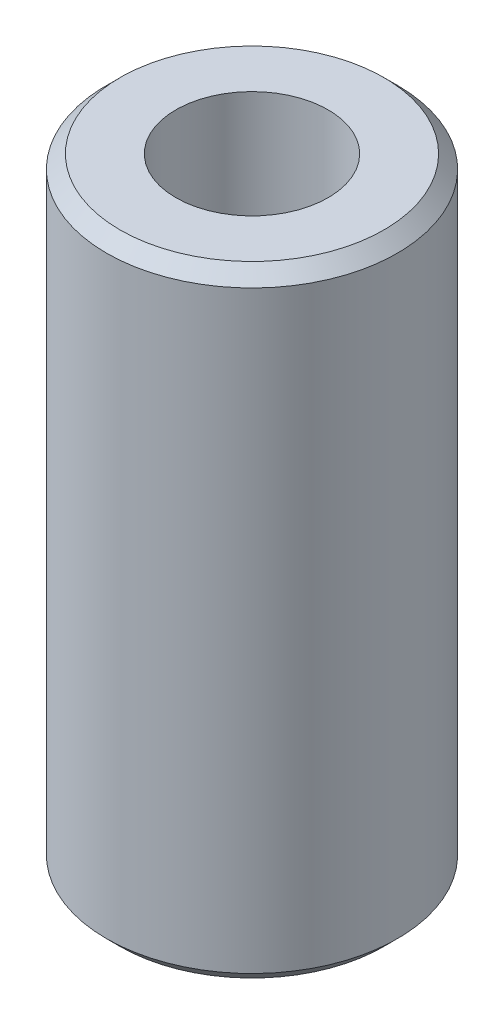
ISO-10303-21;
HEADER;
FILE_DESCRIPTION(('STEP AP214'),'2;1');
FILE_NAME('part.step','',(''),(''),'','','');
FILE_SCHEMA(('AUTOMOTIVE_DESIGN { 1 0 10303 214 1 1 1 1 }'));
ENDSEC;
DATA;
#1=APPLICATION_CONTEXT('core data for automotive mechanical design processes');
#2=APPLICATION_PROTOCOL_DEFINITION('international standard','automotive_design',2000,#1);
#3=PRODUCT_CONTEXT('',#1,'mechanical');
#4=PRODUCT('Part','Part','',(#3));
#5=PRODUCT_RELATED_PRODUCT_CATEGORY('part','',(#4));
#6=PRODUCT_DEFINITION_FORMATION('','',#4);
#7=PRODUCT_DEFINITION_CONTEXT('part definition',#1,'design');
#8=PRODUCT_DEFINITION('design','',#6,#7);
#9=PRODUCT_DEFINITION_SHAPE('','',#8);
#10=(LENGTH_UNIT() NAMED_UNIT(*) SI_UNIT(.MILLI.,.METRE.));
#11=(NAMED_UNIT(*) PLANE_ANGLE_UNIT() SI_UNIT($,.RADIAN.));
#12=(NAMED_UNIT(*) SI_UNIT($,.STERADIAN.) SOLID_ANGLE_UNIT());
#13=UNCERTAINTY_MEASURE_WITH_UNIT(LENGTH_MEASURE(1.E-05),#10,'distance_accuracy_value','');
#14=(GEOMETRIC_REPRESENTATION_CONTEXT(3) GLOBAL_UNCERTAINTY_ASSIGNED_CONTEXT((#13)) GLOBAL_UNIT_ASSIGNED_CONTEXT((#10,
#11,#12)) REPRESENTATION_CONTEXT('',''));
#15=CARTESIAN_POINT('',(0.,0.,0.));
#16=DIRECTION('',(0.,0.,1.));
#17=DIRECTION('',(1.,0.,0.));
#18=AXIS2_PLACEMENT_3D('',#15,#16,#17);
#19=CARTESIAN_POINT('',(0.,202.711872177999,0.));
#20=DIRECTION('',(0.,-1.,0.));
#21=DIRECTION('',(0.,0.,-1.));
#22=AXIS2_PLACEMENT_3D('',#19,#20,#21);
#23=CYLINDRICAL_SURFACE('',#22,47.5);
#24=CARTESIAN_POINT('',(0.,198.32315439257,0.));
#25=DIRECTION('',(0.,1.,0.));
#26=DIRECTION('',(0.,0.,1.));
#27=AXIS2_PLACEMENT_3D('',#24,#25,#26);
#28=CIRCLE('',#27,47.5);
#29=CARTESIAN_POINT('',(0.,198.32315439257,47.5));
#30=VERTEX_POINT('',#29);
#31=EDGE_CURVE('E50',#30,#30,#28,.F.);
#32=ORIENTED_EDGE('',*,*,#31,.T.);
#33=EDGE_LOOP('',(#32));
#34=FACE_BOUND('',#33,.T.);
#35=CARTESIAN_POINT('',(0.,4.38871778542918,0.));
#36=DIRECTION('',(0.,1.,0.));
#37=DIRECTION('',(0.,0.,1.));
#38=AXIS2_PLACEMENT_3D('',#35,#36,#37);
#39=CIRCLE('',#38,47.5);
#40=CARTESIAN_POINT('',(0.,4.38871778542918,47.5));
#41=VERTEX_POINT('',#40);
#42=EDGE_CURVE('E51',#41,#41,#39,.T.);
#43=ORIENTED_EDGE('',*,*,#42,.T.);
#44=EDGE_LOOP('',(#43));
#45=FACE_BOUND('',#44,.T.);
#46=ADVANCED_FACE('F39',(#34,#45),#23,.T.);
#47=CARTESIAN_POINT('',(0.,202.711872177999,0.));
#48=DIRECTION('',(0.,1.,0.));
#49=DIRECTION('',(0.,0.,1.));
#50=AXIS2_PLACEMENT_3D('',#47,#48,#49);
#51=PLANE('',#50);
#52=CARTESIAN_POINT('',(0.,202.711872177999,0.));
#53=DIRECTION('',(0.,1.,0.));
#54=DIRECTION('',(0.,0.,1.));
#55=AXIS2_PLACEMENT_3D('',#52,#53,#54);
#56=CIRCLE('',#55,43.1112822145708);
#57=CARTESIAN_POINT('',(0.,202.711872177999,43.1112822145708));
#58=VERTEX_POINT('',#57);
#59=EDGE_CURVE('E54',#58,#58,#56,.T.);
#60=ORIENTED_EDGE('',*,*,#59,.T.);
#61=EDGE_LOOP('',(#60));
#62=FACE_BOUND('',#61,.T.);
#63=CARTESIAN_POINT('',(0.,202.711872177999,0.));
#64=DIRECTION('',(0.,1.,0.));
#65=DIRECTION('',(0.,0.,1.));
#66=AXIS2_PLACEMENT_3D('',#63,#64,#65);
#67=CIRCLE('',#66,24.8795412743355);
#68=CARTESIAN_POINT('',(0.,202.711872177999,24.8795412743355));
#69=VERTEX_POINT('',#68);
#70=EDGE_CURVE('E58',#69,#69,#67,.T.);
#71=ORIENTED_EDGE('',*,*,#70,.F.);
#72=EDGE_LOOP('',(#71));
#73=FACE_BOUND('',#72,.T.);
#74=ADVANCED_FACE('F69',(#62,#73),#51,.T.);
#75=CARTESIAN_POINT('',(0.,0.,0.));
#76=DIRECTION('',(0.,1.,0.));
#77=DIRECTION('',(0.,0.,1.));
#78=AXIS2_PLACEMENT_3D('',#75,#76,#77);
#79=PLANE('',#78);
#80=CARTESIAN_POINT('',(0.,0.,0.));
#81=DIRECTION('',(0.,1.,0.));
#82=DIRECTION('',(0.,0.,1.));
#83=AXIS2_PLACEMENT_3D('',#80,#81,#82);
#84=CIRCLE('',#83,43.1112822145708);
#85=CARTESIAN_POINT('',(0.,0.,43.1112822145708));
#86=VERTEX_POINT('',#85);
#87=EDGE_CURVE('E10',#86,#86,#84,.F.);
#88=ORIENTED_EDGE('',*,*,#87,.T.);
#89=EDGE_LOOP('',(#88));
#90=FACE_BOUND('',#89,.T.);
#91=CARTESIAN_POINT('',(0.,0.,0.));
#92=DIRECTION('',(0.,1.,0.));
#93=DIRECTION('',(0.,0.,1.));
#94=AXIS2_PLACEMENT_3D('',#91,#92,#93);
#95=CIRCLE('',#94,24.8795412743355);
#96=CARTESIAN_POINT('',(0.,0.,24.8795412743355));
#97=VERTEX_POINT('',#96);
#98=EDGE_CURVE('E63',#97,#97,#95,.T.);
#99=ORIENTED_EDGE('',*,*,#98,.T.);
#100=EDGE_LOOP('',(#99));
#101=FACE_BOUND('',#100,.T.);
#102=ADVANCED_FACE('F75',(#90,#101),#79,.F.);
#103=CARTESIAN_POINT('',(0.,202.711872177999,0.));
#104=DIRECTION('',(0.,-1.,0.));
#105=DIRECTION('',(0.,0.,-1.));
#106=AXIS2_PLACEMENT_3D('',#103,#104,#105);
#107=CYLINDRICAL_SURFACE('',#106,24.8795412743355);
#108=ORIENTED_EDGE('',*,*,#70,.T.);
#109=EDGE_LOOP('',(#108));
#110=FACE_BOUND('',#109,.T.);
#111=ORIENTED_EDGE('',*,*,#98,.F.);
#112=EDGE_LOOP('',(#111));
#113=FACE_BOUND('',#112,.T.);
#114=ADVANCED_FACE('F70',(#110,#113),#107,.F.);
#115=CARTESIAN_POINT('',(0.,202.711872177999,0.));
#116=DIRECTION('',(0.,-1.,0.));
#117=DIRECTION('',(0.,0.,-1.));
#118=AXIS2_PLACEMENT_3D('',#115,#116,#117);
#119=CONICAL_SURFACE('',#118,43.1112822145708,0.785398163397448);
#120=ORIENTED_EDGE('',*,*,#31,.F.);
#121=EDGE_LOOP('',(#120));
#122=FACE_BOUND('',#121,.T.);
#123=ORIENTED_EDGE('',*,*,#59,.F.);
#124=EDGE_LOOP('',(#123));
#125=FACE_BOUND('',#124,.T.);
#126=ADVANCED_FACE('F81',(#122,#125),#119,.T.);
#127=CARTESIAN_POINT('',(0.,4.38871778542918,0.));
#128=DIRECTION('',(0.,1.,0.));
#129=DIRECTION('',(0.,0.,1.));
#130=AXIS2_PLACEMENT_3D('',#127,#128,#129);
#131=CONICAL_SURFACE('',#130,47.5,0.785398163397451);
#132=ORIENTED_EDGE('',*,*,#87,.F.);
#133=EDGE_LOOP('',(#132));
#134=FACE_BOUND('',#133,.T.);
#135=ORIENTED_EDGE('',*,*,#42,.F.);
#136=EDGE_LOOP('',(#135));
#137=FACE_BOUND('',#136,.T.);
#138=ADVANCED_FACE('F45',(#134,#137),#131,.T.);
#139=CLOSED_SHELL('',(#46,#74,#102,#114,#126,#138));
#140=MANIFOLD_SOLID_BREP('B2',#139);
#141=ADVANCED_BREP_SHAPE_REPRESENTATION('',(#18,#140),#14);
#142=SHAPE_DEFINITION_REPRESENTATION(#9,#141);
ENDSEC;
END-ISO-10303-21;
